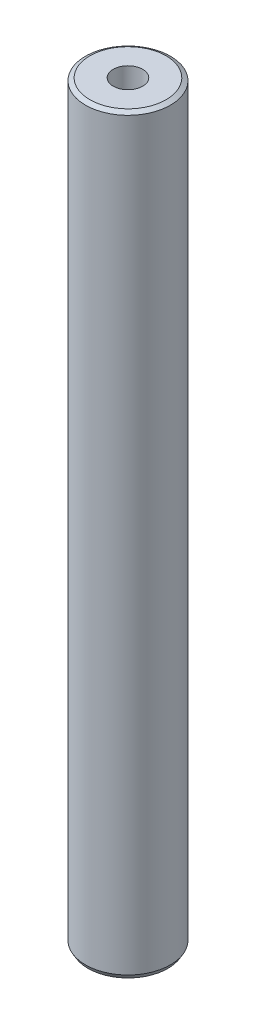
ISO-10303-21;
HEADER;
FILE_DESCRIPTION(('STEP AP214'),'2;1');
FILE_NAME('part.step','',(''),(''),'','','');
FILE_SCHEMA(('AUTOMOTIVE_DESIGN { 1 0 10303 214 1 1 1 1 }'));
ENDSEC;
DATA;
#1=APPLICATION_CONTEXT('core data for automotive mechanical design processes');
#2=APPLICATION_PROTOCOL_DEFINITION('international standard','automotive_design',2000,#1);
#3=PRODUCT_CONTEXT('',#1,'mechanical');
#4=PRODUCT('Part','Part','',(#3));
#5=PRODUCT_RELATED_PRODUCT_CATEGORY('part','',(#4));
#6=PRODUCT_DEFINITION_FORMATION('','',#4);
#7=PRODUCT_DEFINITION_CONTEXT('part definition',#1,'design');
#8=PRODUCT_DEFINITION('design','',#6,#7);
#9=PRODUCT_DEFINITION_SHAPE('','',#8);
#10=(LENGTH_UNIT() NAMED_UNIT(*) SI_UNIT(.MILLI.,.METRE.));
#11=(NAMED_UNIT(*) PLANE_ANGLE_UNIT() SI_UNIT($,.RADIAN.));
#12=(NAMED_UNIT(*) SI_UNIT($,.STERADIAN.) SOLID_ANGLE_UNIT());
#13=UNCERTAINTY_MEASURE_WITH_UNIT(LENGTH_MEASURE(1.E-05),#10,'distance_accuracy_value','');
#14=(GEOMETRIC_REPRESENTATION_CONTEXT(3) GLOBAL_UNCERTAINTY_ASSIGNED_CONTEXT((#13)) GLOBAL_UNIT_ASSIGNED_CONTEXT((#10,
#11,#12)) REPRESENTATION_CONTEXT('',''));
#15=CARTESIAN_POINT('',(0.,0.,0.));
#16=DIRECTION('',(0.,0.,1.));
#17=DIRECTION('',(1.,0.,0.));
#18=AXIS2_PLACEMENT_3D('',#15,#16,#17);
#19=CARTESIAN_POINT('',(0.,353.947255212373,0.));
#20=DIRECTION('',(0.,-1.,0.));
#21=DIRECTION('',(0.,0.,-1.));
#22=AXIS2_PLACEMENT_3D('',#19,#20,#21);
#23=CYLINDRICAL_SURFACE('',#22,20.);
#24=CARTESIAN_POINT('',(0.,352.757275684452,0.));
#25=DIRECTION('',(0.,1.,0.));
#26=DIRECTION('',(0.,0.,1.));
#27=AXIS2_PLACEMENT_3D('',#24,#25,#26);
#28=CIRCLE('',#27,20.);
#29=CARTESIAN_POINT('',(0.,352.757275684452,20.));
#30=VERTEX_POINT('',#29);
#31=EDGE_CURVE('E50',#30,#30,#28,.F.);
#32=ORIENTED_EDGE('',*,*,#31,.T.);
#33=EDGE_LOOP('',(#32));
#34=FACE_BOUND('',#33,.T.);
#35=CARTESIAN_POINT('',(0.,2.06110500232692,0.));
#36=DIRECTION('',(0.,1.,0.));
#37=DIRECTION('',(0.,0.,1.));
#38=AXIS2_PLACEMENT_3D('',#35,#36,#37);
#39=CIRCLE('',#38,20.);
#40=CARTESIAN_POINT('',(0.,2.06110500232692,20.));
#41=VERTEX_POINT('',#40);
#42=EDGE_CURVE('E51',#41,#41,#39,.T.);
#43=ORIENTED_EDGE('',*,*,#42,.T.);
#44=EDGE_LOOP('',(#43));
#45=FACE_BOUND('',#44,.T.);
#46=ADVANCED_FACE('F39',(#34,#45),#23,.T.);
#47=CARTESIAN_POINT('',(0.,353.947255212373,0.));
#48=DIRECTION('',(0.,1.,0.));
#49=DIRECTION('',(0.,0.,1.));
#50=AXIS2_PLACEMENT_3D('',#47,#48,#49);
#51=PLANE('',#50);
#52=CARTESIAN_POINT('',(0.,353.947255212373,0.));
#53=DIRECTION('',(0.,1.,0.));
#54=DIRECTION('',(0.,0.,1.));
#55=AXIS2_PLACEMENT_3D('',#52,#53,#54);
#56=CIRCLE('',#55,17.9388949976731);
#57=CARTESIAN_POINT('',(0.,353.947255212373,17.9388949976731));
#58=VERTEX_POINT('',#57);
#59=EDGE_CURVE('E54',#58,#58,#56,.T.);
#60=ORIENTED_EDGE('',*,*,#59,.T.);
#61=EDGE_LOOP('',(#60));
#62=FACE_BOUND('',#61,.T.);
#63=CARTESIAN_POINT('',(0.,353.947255212373,0.));
#64=DIRECTION('',(0.,1.,0.));
#65=DIRECTION('',(0.,0.,1.));
#66=AXIS2_PLACEMENT_3D('',#63,#64,#65);
#67=CIRCLE('',#66,6.93000717488572);
#68=CARTESIAN_POINT('',(0.,353.947255212373,6.93000717488572));
#69=VERTEX_POINT('',#68);
#70=EDGE_CURVE('E58',#69,#69,#67,.T.);
#71=ORIENTED_EDGE('',*,*,#70,.F.);
#72=EDGE_LOOP('',(#71));
#73=FACE_BOUND('',#72,.T.);
#74=ADVANCED_FACE('F69',(#62,#73),#51,.T.);
#75=CARTESIAN_POINT('',(0.,0.,0.));
#76=DIRECTION('',(0.,1.,0.));
#77=DIRECTION('',(0.,0.,1.));
#78=AXIS2_PLACEMENT_3D('',#75,#76,#77);
#79=PLANE('',#78);
#80=CARTESIAN_POINT('',(0.,0.,0.));
#81=DIRECTION('',(0.,1.,0.));
#82=DIRECTION('',(0.,0.,1.));
#83=AXIS2_PLACEMENT_3D('',#80,#81,#82);
#84=CIRCLE('',#83,18.8100204720784);
#85=CARTESIAN_POINT('',(0.,0.,18.8100204720784));
#86=VERTEX_POINT('',#85);
#87=EDGE_CURVE('E10',#86,#86,#84,.F.);
#88=ORIENTED_EDGE('',*,*,#87,.T.);
#89=EDGE_LOOP('',(#88));
#90=FACE_BOUND('',#89,.T.);
#91=CARTESIAN_POINT('',(0.,0.,0.));
#92=DIRECTION('',(0.,1.,0.));
#93=DIRECTION('',(0.,0.,1.));
#94=AXIS2_PLACEMENT_3D('',#91,#92,#93);
#95=CIRCLE('',#94,6.93000717488572);
#96=CARTESIAN_POINT('',(0.,0.,6.93000717488572));
#97=VERTEX_POINT('',#96);
#98=EDGE_CURVE('E63',#97,#97,#95,.T.);
#99=ORIENTED_EDGE('',*,*,#98,.T.);
#100=EDGE_LOOP('',(#99));
#101=FACE_BOUND('',#100,.T.);
#102=ADVANCED_FACE('F75',(#90,#101),#79,.F.);
#103=CARTESIAN_POINT('',(0.,353.947255212373,0.));
#104=DIRECTION('',(0.,-1.,0.));
#105=DIRECTION('',(0.,0.,-1.));
#106=AXIS2_PLACEMENT_3D('',#103,#104,#105);
#107=CYLINDRICAL_SURFACE('',#106,6.93000717488572);
#108=ORIENTED_EDGE('',*,*,#70,.T.);
#109=EDGE_LOOP('',(#108));
#110=FACE_BOUND('',#109,.T.);
#111=ORIENTED_EDGE('',*,*,#98,.F.);
#112=EDGE_LOOP('',(#111));
#113=FACE_BOUND('',#112,.T.);
#114=ADVANCED_FACE('F70',(#110,#113),#107,.F.);
#115=CARTESIAN_POINT('',(0.,353.947255212373,0.));
#116=DIRECTION('',(0.,-1.,0.));
#117=DIRECTION('',(0.,0.,-1.));
#118=AXIS2_PLACEMENT_3D('',#115,#116,#117);
#119=CONICAL_SURFACE('',#118,17.9388949976731,1.04719755119658);
#120=ORIENTED_EDGE('',*,*,#31,.F.);
#121=EDGE_LOOP('',(#120));
#122=FACE_BOUND('',#121,.T.);
#123=ORIENTED_EDGE('',*,*,#59,.F.);
#124=EDGE_LOOP('',(#123));
#125=FACE_BOUND('',#124,.T.);
#126=ADVANCED_FACE('F81',(#122,#125),#119,.T.);
#127=CARTESIAN_POINT('',(0.,2.06110500232692,0.));
#128=DIRECTION('',(0.,1.,0.));
#129=DIRECTION('',(0.,0.,1.));
#130=AXIS2_PLACEMENT_3D('',#127,#128,#129);
#131=CONICAL_SURFACE('',#130,20.,0.523598775598308);
#132=ORIENTED_EDGE('',*,*,#87,.F.);
#133=EDGE_LOOP('',(#132));
#134=FACE_BOUND('',#133,.T.);
#135=ORIENTED_EDGE('',*,*,#42,.F.);
#136=EDGE_LOOP('',(#135));
#137=FACE_BOUND('',#136,.T.);
#138=ADVANCED_FACE('F45',(#134,#137),#131,.T.);
#139=CLOSED_SHELL('',(#46,#74,#102,#114,#126,#138));
#140=MANIFOLD_SOLID_BREP('B2',#139);
#141=ADVANCED_BREP_SHAPE_REPRESENTATION('',(#18,#140),#14);
#142=SHAPE_DEFINITION_REPRESENTATION(#9,#141);
ENDSEC;
END-ISO-10303-21;
